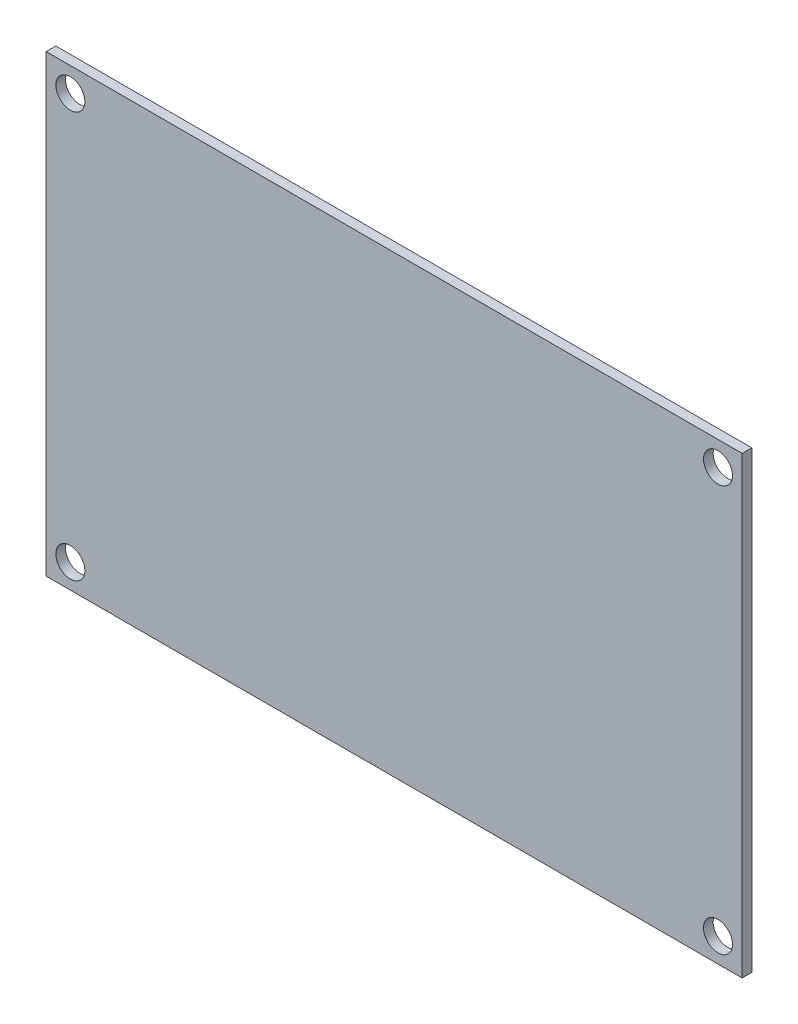
ISO-10303-21;
HEADER;
FILE_DESCRIPTION(('STEP AP214'),'2;1');
FILE_NAME('part.step','',(''),(''),'','','');
FILE_SCHEMA(('AUTOMOTIVE_DESIGN { 1 0 10303 214 1 1 1 1 }'));
ENDSEC;
DATA;
#1=APPLICATION_CONTEXT('core data for automotive mechanical design processes');
#2=APPLICATION_PROTOCOL_DEFINITION('international standard','automotive_design',2000,#1);
#3=PRODUCT_CONTEXT('',#1,'mechanical');
#4=PRODUCT('Part','Part','',(#3));
#5=PRODUCT_RELATED_PRODUCT_CATEGORY('part','',(#4));
#6=PRODUCT_DEFINITION_FORMATION('','',#4);
#7=PRODUCT_DEFINITION_CONTEXT('part definition',#1,'design');
#8=PRODUCT_DEFINITION('design','',#6,#7);
#9=PRODUCT_DEFINITION_SHAPE('','',#8);
#10=(LENGTH_UNIT() NAMED_UNIT(*) SI_UNIT(.MILLI.,.METRE.));
#11=(NAMED_UNIT(*) PLANE_ANGLE_UNIT() SI_UNIT($,.RADIAN.));
#12=(NAMED_UNIT(*) SI_UNIT($,.STERADIAN.) SOLID_ANGLE_UNIT());
#13=UNCERTAINTY_MEASURE_WITH_UNIT(LENGTH_MEASURE(1.E-05),#10,'distance_accuracy_value','');
#14=(GEOMETRIC_REPRESENTATION_CONTEXT(3) GLOBAL_UNCERTAINTY_ASSIGNED_CONTEXT((#13)) GLOBAL_UNIT_ASSIGNED_CONTEXT((#10,
#11,#12)) REPRESENTATION_CONTEXT('',''));
#15=CARTESIAN_POINT('',(0.,0.,0.));
#16=DIRECTION('',(0.,0.,1.));
#17=DIRECTION('',(1.,0.,0.));
#18=AXIS2_PLACEMENT_3D('',#15,#16,#17);
#19=CARTESIAN_POINT('',(-72.,47.,1.));
#20=DIRECTION('',(1.,0.,0.));
#21=DIRECTION('',(0.,1.,0.));
#22=AXIS2_PLACEMENT_3D('',#19,#20,#21);
#23=PLANE('',#22);
#24=DIRECTION('',(0.,-1.,0.));
#25=VECTOR('',#24,1.);
#26=CARTESIAN_POINT('',(-72.,47.,0.));
#27=LINE('',#26,#25);
#28=CARTESIAN_POINT('',(-72.,47.,0.));
#29=VERTEX_POINT('',#28);
#30=CARTESIAN_POINT('',(-72.,0.,0.));
#31=VERTEX_POINT('',#30);
#32=EDGE_CURVE('E96',#29,#31,#27,.T.);
#33=ORIENTED_EDGE('',*,*,#32,.T.);
#34=DIRECTION('',(0.,0.,-1.));
#35=VECTOR('',#34,1.);
#36=CARTESIAN_POINT('',(-72.,0.,1.));
#37=LINE('',#36,#35);
#38=CARTESIAN_POINT('',(-72.,0.,1.));
#39=VERTEX_POINT('',#38);
#40=EDGE_CURVE('E11',#39,#31,#37,.T.);
#41=ORIENTED_EDGE('',*,*,#40,.F.);
#42=DIRECTION('',(0.,-1.,0.));
#43=VECTOR('',#42,1.);
#44=CARTESIAN_POINT('',(-72.,47.,1.));
#45=LINE('',#44,#43);
#46=CARTESIAN_POINT('',(-72.,47.,1.));
#47=VERTEX_POINT('',#46);
#48=EDGE_CURVE('E84',#47,#39,#45,.T.);
#49=ORIENTED_EDGE('',*,*,#48,.F.);
#50=DIRECTION('',(0.,0.,-1.));
#51=VECTOR('',#50,1.);
#52=CARTESIAN_POINT('',(-72.,47.,1.));
#53=LINE('',#52,#51);
#54=EDGE_CURVE('E92',#47,#29,#53,.T.);
#55=ORIENTED_EDGE('',*,*,#54,.T.);
#56=EDGE_LOOP('',(#33,#41,#49,#55));
#57=FACE_BOUND('',#56,.T.);
#58=ADVANCED_FACE('F33',(#57),#23,.F.);
#59=CARTESIAN_POINT('',(-72.,0.,1.));
#60=DIRECTION('',(0.,1.,0.));
#61=DIRECTION('',(0.,0.,1.));
#62=AXIS2_PLACEMENT_3D('',#59,#60,#61);
#63=PLANE('',#62);
#64=DIRECTION('',(1.,0.,0.));
#65=VECTOR('',#64,1.);
#66=CARTESIAN_POINT('',(-72.,0.,0.));
#67=LINE('',#66,#65);
#68=CARTESIAN_POINT('',(0.,0.,0.));
#69=VERTEX_POINT('',#68);
#70=EDGE_CURVE('E88',#31,#69,#67,.T.);
#71=ORIENTED_EDGE('',*,*,#70,.T.);
#72=DIRECTION('',(0.,0.,-1.));
#73=VECTOR('',#72,1.);
#74=CARTESIAN_POINT('',(0.,0.,1.));
#75=LINE('',#74,#73);
#76=CARTESIAN_POINT('',(0.,0.,1.));
#77=VERTEX_POINT('',#76);
#78=EDGE_CURVE('E41',#77,#69,#75,.T.);
#79=ORIENTED_EDGE('',*,*,#78,.F.);
#80=DIRECTION('',(1.,0.,0.));
#81=VECTOR('',#80,1.);
#82=CARTESIAN_POINT('',(-72.,0.,1.));
#83=LINE('',#82,#81);
#84=EDGE_CURVE('E79',#39,#77,#83,.T.);
#85=ORIENTED_EDGE('',*,*,#84,.F.);
#86=ORIENTED_EDGE('',*,*,#40,.T.);
#87=EDGE_LOOP('',(#71,#79,#85,#86));
#88=FACE_BOUND('',#87,.T.);
#89=ADVANCED_FACE('F87',(#88),#63,.F.);
#90=CARTESIAN_POINT('',(0.,47.,1.));
#91=DIRECTION('',(-1.,0.,0.));
#92=DIRECTION('',(0.,0.,1.));
#93=AXIS2_PLACEMENT_3D('',#90,#91,#92);
#94=PLANE('',#93);
#95=DIRECTION('',(0.,1.,0.));
#96=VECTOR('',#95,1.);
#97=CARTESIAN_POINT('',(0.,47.,0.));
#98=LINE('',#97,#96);
#99=CARTESIAN_POINT('',(0.,47.,0.));
#100=VERTEX_POINT('',#99);
#101=EDGE_CURVE('E66',#69,#100,#98,.T.);
#102=ORIENTED_EDGE('',*,*,#101,.T.);
#103=DIRECTION('',(0.,0.,-1.));
#104=VECTOR('',#103,1.);
#105=CARTESIAN_POINT('',(0.,47.,1.));
#106=LINE('',#105,#104);
#107=CARTESIAN_POINT('',(0.,47.,1.));
#108=VERTEX_POINT('',#107);
#109=EDGE_CURVE('E89',#108,#100,#106,.T.);
#110=ORIENTED_EDGE('',*,*,#109,.F.);
#111=DIRECTION('',(0.,1.,0.));
#112=VECTOR('',#111,1.);
#113=CARTESIAN_POINT('',(0.,47.,1.));
#114=LINE('',#113,#112);
#115=EDGE_CURVE('E82',#77,#108,#114,.T.);
#116=ORIENTED_EDGE('',*,*,#115,.F.);
#117=ORIENTED_EDGE('',*,*,#78,.T.);
#118=EDGE_LOOP('',(#102,#110,#116,#117));
#119=FACE_BOUND('',#118,.T.);
#120=ADVANCED_FACE('F90',(#119),#94,.F.);
#121=CARTESIAN_POINT('',(-72.,47.,1.));
#122=DIRECTION('',(0.,-1.,0.));
#123=DIRECTION('',(0.,0.,-1.));
#124=AXIS2_PLACEMENT_3D('',#121,#122,#123);
#125=PLANE('',#124);
#126=DIRECTION('',(-1.,0.,0.));
#127=VECTOR('',#126,1.);
#128=CARTESIAN_POINT('',(-72.,47.,0.));
#129=LINE('',#128,#127);
#130=EDGE_CURVE('E72',#100,#29,#129,.T.);
#131=ORIENTED_EDGE('',*,*,#130,.T.);
#132=ORIENTED_EDGE('',*,*,#54,.F.);
#133=DIRECTION('',(-1.,0.,0.));
#134=VECTOR('',#133,1.);
#135=CARTESIAN_POINT('',(-72.,47.,1.));
#136=LINE('',#135,#134);
#137=EDGE_CURVE('E49',#108,#47,#136,.T.);
#138=ORIENTED_EDGE('',*,*,#137,.F.);
#139=ORIENTED_EDGE('',*,*,#109,.T.);
#140=EDGE_LOOP('',(#131,#132,#138,#139));
#141=FACE_BOUND('',#140,.T.);
#142=ADVANCED_FACE('F104',(#141),#125,.F.);
#143=CARTESIAN_POINT('',(0.,0.,1.));
#144=DIRECTION('',(0.,0.,1.));
#145=DIRECTION('',(1.,0.,0.));
#146=AXIS2_PLACEMENT_3D('',#143,#144,#145);
#147=PLANE('',#146);
#148=CARTESIAN_POINT('',(-69.5,2.5,1.));
#149=DIRECTION('',(0.,0.,1.));
#150=DIRECTION('',(1.,0.,0.));
#151=AXIS2_PLACEMENT_3D('',#148,#149,#150);
#152=CIRCLE('',#151,1.5);
#153=CARTESIAN_POINT('',(-68.,2.5,1.));
#154=VERTEX_POINT('',#153);
#155=EDGE_CURVE('E123',#154,#154,#152,.T.);
#156=ORIENTED_EDGE('',*,*,#155,.F.);
#157=EDGE_LOOP('',(#156));
#158=FACE_BOUND('',#157,.T.);
#159=CARTESIAN_POINT('',(-2.5,44.5,1.));
#160=DIRECTION('',(0.,0.,1.));
#161=DIRECTION('',(1.,0.,0.));
#162=AXIS2_PLACEMENT_3D('',#159,#160,#161);
#163=CIRCLE('',#162,1.5);
#164=CARTESIAN_POINT('',(-0.999999999999999,44.5,1.));
#165=VERTEX_POINT('',#164);
#166=EDGE_CURVE('E116',#165,#165,#163,.T.);
#167=ORIENTED_EDGE('',*,*,#166,.F.);
#168=EDGE_LOOP('',(#167));
#169=FACE_BOUND('',#168,.T.);
#170=CARTESIAN_POINT('',(-2.5,2.5,1.));
#171=DIRECTION('',(0.,0.,1.));
#172=DIRECTION('',(1.,0.,0.));
#173=AXIS2_PLACEMENT_3D('',#170,#171,#172);
#174=CIRCLE('',#173,1.5);
#175=CARTESIAN_POINT('',(-1.,2.5,1.));
#176=VERTEX_POINT('',#175);
#177=EDGE_CURVE('E128',#176,#176,#174,.T.);
#178=ORIENTED_EDGE('',*,*,#177,.F.);
#179=EDGE_LOOP('',(#178));
#180=FACE_BOUND('',#179,.T.);
#181=CARTESIAN_POINT('',(-69.5,44.5,1.));
#182=DIRECTION('',(0.,0.,1.));
#183=DIRECTION('',(1.,0.,0.));
#184=AXIS2_PLACEMENT_3D('',#181,#182,#183);
#185=CIRCLE('',#184,1.5);
#186=CARTESIAN_POINT('',(-68.,44.5,1.));
#187=VERTEX_POINT('',#186);
#188=EDGE_CURVE('E110',#187,#187,#185,.T.);
#189=ORIENTED_EDGE('',*,*,#188,.F.);
#190=EDGE_LOOP('',(#189));
#191=FACE_BOUND('',#190,.T.);
#192=ORIENTED_EDGE('',*,*,#48,.T.);
#193=ORIENTED_EDGE('',*,*,#84,.T.);
#194=ORIENTED_EDGE('',*,*,#115,.T.);
#195=ORIENTED_EDGE('',*,*,#137,.T.);
#196=EDGE_LOOP('',(#192,#193,#194,#195));
#197=FACE_BOUND('',#196,.T.);
#198=ADVANCED_FACE('F80',(#158,#169,#180,#191,#197),#147,.T.);
#199=CARTESIAN_POINT('',(0.,0.,0.));
#200=DIRECTION('',(0.,0.,1.));
#201=DIRECTION('',(1.,0.,0.));
#202=AXIS2_PLACEMENT_3D('',#199,#200,#201);
#203=PLANE('',#202);
#204=CARTESIAN_POINT('',(-69.5,2.5,0.));
#205=DIRECTION('',(0.,0.,1.));
#206=DIRECTION('',(1.,0.,0.));
#207=AXIS2_PLACEMENT_3D('',#204,#205,#206);
#208=CIRCLE('',#207,1.5);
#209=CARTESIAN_POINT('',(-68.,2.5,0.));
#210=VERTEX_POINT('',#209);
#211=EDGE_CURVE('E113',#210,#210,#208,.T.);
#212=ORIENTED_EDGE('',*,*,#211,.T.);
#213=EDGE_LOOP('',(#212));
#214=FACE_BOUND('',#213,.T.);
#215=CARTESIAN_POINT('',(-2.5,44.5,0.));
#216=DIRECTION('',(0.,0.,1.));
#217=DIRECTION('',(1.,0.,0.));
#218=AXIS2_PLACEMENT_3D('',#215,#216,#217);
#219=CIRCLE('',#218,1.5);
#220=CARTESIAN_POINT('',(-0.999999999999999,44.5,0.));
#221=VERTEX_POINT('',#220);
#222=EDGE_CURVE('E119',#221,#221,#219,.T.);
#223=ORIENTED_EDGE('',*,*,#222,.T.);
#224=EDGE_LOOP('',(#223));
#225=FACE_BOUND('',#224,.T.);
#226=CARTESIAN_POINT('',(-2.5,2.5,0.));
#227=DIRECTION('',(0.,0.,1.));
#228=DIRECTION('',(1.,0.,0.));
#229=AXIS2_PLACEMENT_3D('',#226,#227,#228);
#230=CIRCLE('',#229,1.5);
#231=CARTESIAN_POINT('',(-1.,2.5,0.));
#232=VERTEX_POINT('',#231);
#233=EDGE_CURVE('E120',#232,#232,#230,.T.);
#234=ORIENTED_EDGE('',*,*,#233,.T.);
#235=EDGE_LOOP('',(#234));
#236=FACE_BOUND('',#235,.T.);
#237=CARTESIAN_POINT('',(-69.5,44.5,0.));
#238=DIRECTION('',(0.,0.,1.));
#239=DIRECTION('',(1.,0.,0.));
#240=AXIS2_PLACEMENT_3D('',#237,#238,#239);
#241=CIRCLE('',#240,1.5);
#242=CARTESIAN_POINT('',(-68.,44.5,0.));
#243=VERTEX_POINT('',#242);
#244=EDGE_CURVE('E99',#243,#243,#241,.T.);
#245=ORIENTED_EDGE('',*,*,#244,.T.);
#246=EDGE_LOOP('',(#245));
#247=FACE_BOUND('',#246,.T.);
#248=ORIENTED_EDGE('',*,*,#32,.F.);
#249=ORIENTED_EDGE('',*,*,#130,.F.);
#250=ORIENTED_EDGE('',*,*,#101,.F.);
#251=ORIENTED_EDGE('',*,*,#70,.F.);
#252=EDGE_LOOP('',(#248,#249,#250,#251));
#253=FACE_BOUND('',#252,.T.);
#254=ADVANCED_FACE('F107',(#214,#225,#236,#247,#253),#203,.F.);
#255=CARTESIAN_POINT('',(-69.5,44.5,0.));
#256=DIRECTION('',(0.,0.,1.));
#257=DIRECTION('',(1.,0.,0.));
#258=AXIS2_PLACEMENT_3D('',#255,#256,#257);
#259=CYLINDRICAL_SURFACE('',#258,1.5);
#260=ORIENTED_EDGE('',*,*,#244,.F.);
#261=EDGE_LOOP('',(#260));
#262=FACE_BOUND('',#261,.T.);
#263=ORIENTED_EDGE('',*,*,#188,.T.);
#264=EDGE_LOOP('',(#263));
#265=FACE_BOUND('',#264,.T.);
#266=ADVANCED_FACE('F140',(#262,#265),#259,.F.);
#267=CARTESIAN_POINT('',(-2.5,2.5,0.));
#268=DIRECTION('',(0.,0.,1.));
#269=DIRECTION('',(1.,0.,0.));
#270=AXIS2_PLACEMENT_3D('',#267,#268,#269);
#271=CYLINDRICAL_SURFACE('',#270,1.5);
#272=ORIENTED_EDGE('',*,*,#233,.F.);
#273=EDGE_LOOP('',(#272));
#274=FACE_BOUND('',#273,.T.);
#275=ORIENTED_EDGE('',*,*,#177,.T.);
#276=EDGE_LOOP('',(#275));
#277=FACE_BOUND('',#276,.T.);
#278=ADVANCED_FACE('F136',(#274,#277),#271,.F.);
#279=CARTESIAN_POINT('',(-2.5,44.5,0.));
#280=DIRECTION('',(0.,0.,1.));
#281=DIRECTION('',(1.,0.,0.));
#282=AXIS2_PLACEMENT_3D('',#279,#280,#281);
#283=CYLINDRICAL_SURFACE('',#282,1.5);
#284=ORIENTED_EDGE('',*,*,#222,.F.);
#285=EDGE_LOOP('',(#284));
#286=FACE_BOUND('',#285,.T.);
#287=ORIENTED_EDGE('',*,*,#166,.T.);
#288=EDGE_LOOP('',(#287));
#289=FACE_BOUND('',#288,.T.);
#290=ADVANCED_FACE('F139',(#286,#289),#283,.F.);
#291=CARTESIAN_POINT('',(-69.5,2.5,0.));
#292=DIRECTION('',(0.,0.,1.));
#293=DIRECTION('',(1.,0.,0.));
#294=AXIS2_PLACEMENT_3D('',#291,#292,#293);
#295=CYLINDRICAL_SURFACE('',#294,1.5);
#296=ORIENTED_EDGE('',*,*,#211,.F.);
#297=EDGE_LOOP('',(#296));
#298=FACE_BOUND('',#297,.T.);
#299=ORIENTED_EDGE('',*,*,#155,.T.);
#300=EDGE_LOOP('',(#299));
#301=FACE_BOUND('',#300,.T.);
#302=ADVANCED_FACE('F201',(#298,#301),#295,.F.);
#303=CLOSED_SHELL('',(#58,#89,#120,#142,#198,#254,#266,#278,#290,#302));
#304=MANIFOLD_SOLID_BREP('B2',#303);
#305=ADVANCED_BREP_SHAPE_REPRESENTATION('',(#18,#304),#14);
#306=SHAPE_DEFINITION_REPRESENTATION(#9,#305);
ENDSEC;
END-ISO-10303-21;
